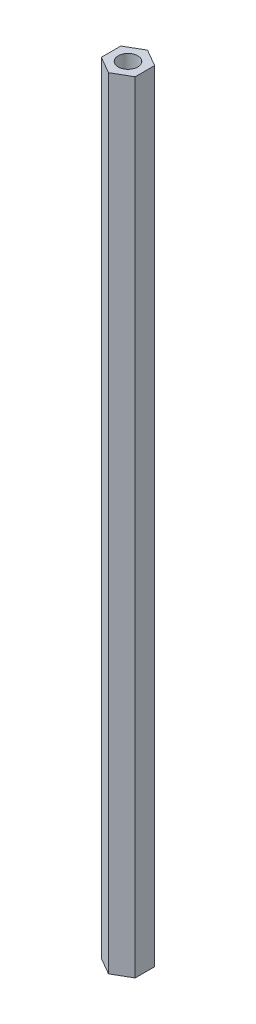
ISO-10303-21;
HEADER;
FILE_DESCRIPTION(('STEP AP214'),'2;1');
FILE_NAME('part.step','',(''),(''),'','','');
FILE_SCHEMA(('AUTOMOTIVE_DESIGN { 1 0 10303 214 1 1 1 1 }'));
ENDSEC;
DATA;
#1=APPLICATION_CONTEXT('core data for automotive mechanical design processes');
#2=APPLICATION_PROTOCOL_DEFINITION('international standard','automotive_design',2000,#1);
#3=PRODUCT_CONTEXT('',#1,'mechanical');
#4=PRODUCT('Part','Part','',(#3));
#5=PRODUCT_RELATED_PRODUCT_CATEGORY('part','',(#4));
#6=PRODUCT_DEFINITION_FORMATION('','',#4);
#7=PRODUCT_DEFINITION_CONTEXT('part definition',#1,'design');
#8=PRODUCT_DEFINITION('design','',#6,#7);
#9=PRODUCT_DEFINITION_SHAPE('','',#8);
#10=(LENGTH_UNIT() NAMED_UNIT(*) SI_UNIT(.MILLI.,.METRE.));
#11=(NAMED_UNIT(*) PLANE_ANGLE_UNIT() SI_UNIT($,.RADIAN.));
#12=(NAMED_UNIT(*) SI_UNIT($,.STERADIAN.) SOLID_ANGLE_UNIT());
#13=UNCERTAINTY_MEASURE_WITH_UNIT(LENGTH_MEASURE(1.E-05),#10,'distance_accuracy_value','');
#14=(GEOMETRIC_REPRESENTATION_CONTEXT(3) GLOBAL_UNCERTAINTY_ASSIGNED_CONTEXT((#13)) GLOBAL_UNIT_ASSIGNED_CONTEXT((#10,
#11,#12)) REPRESENTATION_CONTEXT('',''));
#15=CARTESIAN_POINT('',(0.,0.,0.));
#16=DIRECTION('',(0.,0.,1.));
#17=DIRECTION('',(1.,0.,0.));
#18=AXIS2_PLACEMENT_3D('',#15,#16,#17);
#19=CARTESIAN_POINT('',(0.,200.,-5.));
#20=DIRECTION('',(0.,1.,0.));
#21=DIRECTION('',(0.,0.,1.));
#22=AXIS2_PLACEMENT_3D('',#19,#20,#21);
#23=PLANE('',#22);
#24=DIRECTION('',(-0.866025403784439,0.,-0.5));
#25=VECTOR('',#24,1.);
#26=CARTESIAN_POINT('',(4.33012701892219,200.,-2.5));
#27=LINE('',#26,#25);
#28=CARTESIAN_POINT('',(4.33012701892219,200.,-2.5));
#29=VERTEX_POINT('',#28);
#30=CARTESIAN_POINT('',(0.,200.,-5.));
#31=VERTEX_POINT('',#30);
#32=EDGE_CURVE('E127',#29,#31,#27,.T.);
#33=ORIENTED_EDGE('',*,*,#32,.T.);
#34=DIRECTION('',(-0.866025403784439,0.,0.5));
#35=VECTOR('',#34,1.);
#36=CARTESIAN_POINT('',(0.,200.,-5.));
#37=LINE('',#36,#35);
#38=CARTESIAN_POINT('',(-4.33012701892219,200.,-2.5));
#39=VERTEX_POINT('',#38);
#40=EDGE_CURVE('E85',#31,#39,#37,.T.);
#41=ORIENTED_EDGE('',*,*,#40,.T.);
#42=DIRECTION('',(0.,0.,1.));
#43=VECTOR('',#42,1.);
#44=CARTESIAN_POINT('',(-4.33012701892219,200.,-2.5));
#45=LINE('',#44,#43);
#46=CARTESIAN_POINT('',(-4.33012701892219,200.,2.5));
#47=VERTEX_POINT('',#46);
#48=EDGE_CURVE('E98',#39,#47,#45,.T.);
#49=ORIENTED_EDGE('',*,*,#48,.T.);
#50=DIRECTION('',(0.866025403784439,0.,0.5));
#51=VECTOR('',#50,1.);
#52=CARTESIAN_POINT('',(-4.33012701892219,200.,2.5));
#53=LINE('',#52,#51);
#54=CARTESIAN_POINT('',(0.,200.,5.));
#55=VERTEX_POINT('',#54);
#56=EDGE_CURVE('E92',#47,#55,#53,.T.);
#57=ORIENTED_EDGE('',*,*,#56,.T.);
#58=DIRECTION('',(0.866025403784439,0.,-0.5));
#59=VECTOR('',#58,1.);
#60=CARTESIAN_POINT('',(0.,200.,5.));
#61=LINE('',#60,#59);
#62=CARTESIAN_POINT('',(4.33012701892219,200.,2.5));
#63=VERTEX_POINT('',#62);
#64=EDGE_CURVE('E96',#55,#63,#61,.T.);
#65=ORIENTED_EDGE('',*,*,#64,.T.);
#66=DIRECTION('',(0.,0.,-1.));
#67=VECTOR('',#66,1.);
#68=CARTESIAN_POINT('',(4.33012701892219,200.,2.5));
#69=LINE('',#68,#67);
#70=EDGE_CURVE('E48',#63,#29,#69,.T.);
#71=ORIENTED_EDGE('',*,*,#70,.T.);
#72=EDGE_LOOP('',(#33,#41,#49,#57,#65,#71));
#73=FACE_BOUND('',#72,.T.);
#74=CARTESIAN_POINT('',(0.,200.,0.));
#75=DIRECTION('',(0.,1.,0.));
#76=DIRECTION('',(0.,0.,1.));
#77=AXIS2_PLACEMENT_3D('',#74,#75,#76);
#78=CIRCLE('',#77,2.5);
#79=CARTESIAN_POINT('',(0.,200.,2.5));
#80=VERTEX_POINT('',#79);
#81=EDGE_CURVE('E120',#80,#80,#78,.T.);
#82=ORIENTED_EDGE('',*,*,#81,.F.);
#83=EDGE_LOOP('',(#82));
#84=FACE_BOUND('',#83,.T.);
#85=ADVANCED_FACE('F31',(#73,#84),#23,.T.);
#86=CARTESIAN_POINT('',(0.,0.,-5.));
#87=DIRECTION('',(0.,1.,0.));
#88=DIRECTION('',(0.,0.,1.));
#89=AXIS2_PLACEMENT_3D('',#86,#87,#88);
#90=PLANE('',#89);
#91=DIRECTION('',(-0.866025403784439,0.,-0.5));
#92=VECTOR('',#91,1.);
#93=CARTESIAN_POINT('',(4.33012701892219,0.,-2.5));
#94=LINE('',#93,#92);
#95=CARTESIAN_POINT('',(4.33012701892219,0.,-2.5));
#96=VERTEX_POINT('',#95);
#97=CARTESIAN_POINT('',(0.,0.,-5.));
#98=VERTEX_POINT('',#97);
#99=EDGE_CURVE('E116',#96,#98,#94,.T.);
#100=ORIENTED_EDGE('',*,*,#99,.F.);
#101=DIRECTION('',(0.,0.,-1.));
#102=VECTOR('',#101,1.);
#103=CARTESIAN_POINT('',(4.33012701892219,0.,2.5));
#104=LINE('',#103,#102);
#105=CARTESIAN_POINT('',(4.33012701892219,0.,2.5));
#106=VERTEX_POINT('',#105);
#107=EDGE_CURVE('E77',#106,#96,#104,.T.);
#108=ORIENTED_EDGE('',*,*,#107,.F.);
#109=DIRECTION('',(0.866025403784439,0.,-0.5));
#110=VECTOR('',#109,1.);
#111=CARTESIAN_POINT('',(0.,0.,5.));
#112=LINE('',#111,#110);
#113=CARTESIAN_POINT('',(0.,0.,5.));
#114=VERTEX_POINT('',#113);
#115=EDGE_CURVE('E71',#114,#106,#112,.T.);
#116=ORIENTED_EDGE('',*,*,#115,.F.);
#117=DIRECTION('',(0.866025403784439,0.,0.5));
#118=VECTOR('',#117,1.);
#119=CARTESIAN_POINT('',(-4.33012701892219,0.,2.5));
#120=LINE('',#119,#118);
#121=CARTESIAN_POINT('',(-4.33012701892219,0.,2.5));
#122=VERTEX_POINT('',#121);
#123=EDGE_CURVE('E106',#122,#114,#120,.T.);
#124=ORIENTED_EDGE('',*,*,#123,.F.);
#125=DIRECTION('',(0.,0.,1.));
#126=VECTOR('',#125,1.);
#127=CARTESIAN_POINT('',(-4.33012701892219,0.,-2.5));
#128=LINE('',#127,#126);
#129=CARTESIAN_POINT('',(-4.33012701892219,0.,-2.5));
#130=VERTEX_POINT('',#129);
#131=EDGE_CURVE('E122',#130,#122,#128,.T.);
#132=ORIENTED_EDGE('',*,*,#131,.F.);
#133=DIRECTION('',(-0.866025403784439,0.,0.5));
#134=VECTOR('',#133,1.);
#135=CARTESIAN_POINT('',(0.,0.,-5.));
#136=LINE('',#135,#134);
#137=EDGE_CURVE('E119',#98,#130,#136,.T.);
#138=ORIENTED_EDGE('',*,*,#137,.F.);
#139=EDGE_LOOP('',(#100,#108,#116,#124,#132,#138));
#140=FACE_BOUND('',#139,.T.);
#141=CARTESIAN_POINT('',(0.,0.,0.));
#142=DIRECTION('',(0.,1.,0.));
#143=DIRECTION('',(0.,0.,1.));
#144=AXIS2_PLACEMENT_3D('',#141,#142,#143);
#145=CIRCLE('',#144,2.5);
#146=CARTESIAN_POINT('',(0.,0.,2.5));
#147=VERTEX_POINT('',#146);
#148=EDGE_CURVE('E220',#147,#147,#145,.T.);
#149=ORIENTED_EDGE('',*,*,#148,.T.);
#150=EDGE_LOOP('',(#149));
#151=FACE_BOUND('',#150,.T.);
#152=ADVANCED_FACE('F136',(#140,#151),#90,.F.);
#153=CARTESIAN_POINT('',(4.33012701892219,200.,-2.5));
#154=DIRECTION('',(-0.5,0.,0.866025403784439));
#155=DIRECTION('',(0.866025403784439,0.,0.5));
#156=AXIS2_PLACEMENT_3D('',#153,#154,#155);
#157=PLANE('',#156);
#158=ORIENTED_EDGE('',*,*,#99,.T.);
#159=DIRECTION('',(0.,-1.,0.));
#160=VECTOR('',#159,1.);
#161=CARTESIAN_POINT('',(0.,200.,-5.));
#162=LINE('',#161,#160);
#163=EDGE_CURVE('E11',#31,#98,#162,.T.);
#164=ORIENTED_EDGE('',*,*,#163,.F.);
#165=ORIENTED_EDGE('',*,*,#32,.F.);
#166=DIRECTION('',(0.,-1.,0.));
#167=VECTOR('',#166,1.);
#168=CARTESIAN_POINT('',(4.33012701892219,200.,-2.5));
#169=LINE('',#168,#167);
#170=EDGE_CURVE('E112',#29,#96,#169,.T.);
#171=ORIENTED_EDGE('',*,*,#170,.T.);
#172=EDGE_LOOP('',(#158,#164,#165,#171));
#173=FACE_BOUND('',#172,.T.);
#174=ADVANCED_FACE('F33',(#173),#157,.F.);
#175=CARTESIAN_POINT('',(0.,200.,-5.));
#176=DIRECTION('',(0.5,0.,0.866025403784439));
#177=DIRECTION('',(0.866025403784439,0.,-0.5));
#178=AXIS2_PLACEMENT_3D('',#175,#176,#177);
#179=PLANE('',#178);
#180=ORIENTED_EDGE('',*,*,#137,.T.);
#181=DIRECTION('',(0.,-1.,0.));
#182=VECTOR('',#181,1.);
#183=CARTESIAN_POINT('',(-4.33012701892219,200.,-2.5));
#184=LINE('',#183,#182);
#185=EDGE_CURVE('E40',#39,#130,#184,.T.);
#186=ORIENTED_EDGE('',*,*,#185,.F.);
#187=ORIENTED_EDGE('',*,*,#40,.F.);
#188=ORIENTED_EDGE('',*,*,#163,.T.);
#189=EDGE_LOOP('',(#180,#186,#187,#188));
#190=FACE_BOUND('',#189,.T.);
#191=ADVANCED_FACE('F161',(#190),#179,.F.);
#192=CARTESIAN_POINT('',(-4.33012701892219,200.,-2.5));
#193=DIRECTION('',(1.,0.,0.));
#194=DIRECTION('',(0.,0.,-1.));
#195=AXIS2_PLACEMENT_3D('',#192,#193,#194);
#196=PLANE('',#195);
#197=ORIENTED_EDGE('',*,*,#131,.T.);
#198=DIRECTION('',(0.,-1.,0.));
#199=VECTOR('',#198,1.);
#200=CARTESIAN_POINT('',(-4.33012701892219,200.,2.5));
#201=LINE('',#200,#199);
#202=EDGE_CURVE('E107',#47,#122,#201,.T.);
#203=ORIENTED_EDGE('',*,*,#202,.F.);
#204=ORIENTED_EDGE('',*,*,#48,.F.);
#205=ORIENTED_EDGE('',*,*,#185,.T.);
#206=EDGE_LOOP('',(#197,#203,#204,#205));
#207=FACE_BOUND('',#206,.T.);
#208=ADVANCED_FACE('F133',(#207),#196,.F.);
#209=CARTESIAN_POINT('',(-4.33012701892219,200.,2.5));
#210=DIRECTION('',(0.5,0.,-0.866025403784439));
#211=DIRECTION('',(-0.866025403784439,0.,-0.5));
#212=AXIS2_PLACEMENT_3D('',#209,#210,#211);
#213=PLANE('',#212);
#214=ORIENTED_EDGE('',*,*,#123,.T.);
#215=DIRECTION('',(0.,-1.,0.));
#216=VECTOR('',#215,1.);
#217=CARTESIAN_POINT('',(0.,200.,5.));
#218=LINE('',#217,#216);
#219=EDGE_CURVE('E103',#55,#114,#218,.T.);
#220=ORIENTED_EDGE('',*,*,#219,.F.);
#221=ORIENTED_EDGE('',*,*,#56,.F.);
#222=ORIENTED_EDGE('',*,*,#202,.T.);
#223=EDGE_LOOP('',(#214,#220,#221,#222));
#224=FACE_BOUND('',#223,.T.);
#225=ADVANCED_FACE('F104',(#224),#213,.F.);
#226=CARTESIAN_POINT('',(0.,200.,5.));
#227=DIRECTION('',(-0.5,0.,-0.866025403784439));
#228=DIRECTION('',(-0.866025403784439,0.,0.5));
#229=AXIS2_PLACEMENT_3D('',#226,#227,#228);
#230=PLANE('',#229);
#231=ORIENTED_EDGE('',*,*,#115,.T.);
#232=DIRECTION('',(0.,-1.,0.));
#233=VECTOR('',#232,1.);
#234=CARTESIAN_POINT('',(4.33012701892219,200.,2.5));
#235=LINE('',#234,#233);
#236=EDGE_CURVE('E108',#63,#106,#235,.T.);
#237=ORIENTED_EDGE('',*,*,#236,.F.);
#238=ORIENTED_EDGE('',*,*,#64,.F.);
#239=ORIENTED_EDGE('',*,*,#219,.T.);
#240=EDGE_LOOP('',(#231,#237,#238,#239));
#241=FACE_BOUND('',#240,.T.);
#242=ADVANCED_FACE('F110',(#241),#230,.F.);
#243=CARTESIAN_POINT('',(4.33012701892219,200.,2.5));
#244=DIRECTION('',(-1.,0.,0.));
#245=DIRECTION('',(0.,0.,1.));
#246=AXIS2_PLACEMENT_3D('',#243,#244,#245);
#247=PLANE('',#246);
#248=ORIENTED_EDGE('',*,*,#107,.T.);
#249=ORIENTED_EDGE('',*,*,#170,.F.);
#250=ORIENTED_EDGE('',*,*,#70,.F.);
#251=ORIENTED_EDGE('',*,*,#236,.T.);
#252=EDGE_LOOP('',(#248,#249,#250,#251));
#253=FACE_BOUND('',#252,.T.);
#254=ADVANCED_FACE('F141',(#253),#247,.F.);
#255=CARTESIAN_POINT('',(0.,200.,0.));
#256=DIRECTION('',(0.,-1.,0.));
#257=DIRECTION('',(0.,0.,-1.));
#258=AXIS2_PLACEMENT_3D('',#255,#256,#257);
#259=CYLINDRICAL_SURFACE('',#258,2.5);
#260=ORIENTED_EDGE('',*,*,#81,.T.);
#261=EDGE_LOOP('',(#260));
#262=FACE_BOUND('',#261,.T.);
#263=ORIENTED_EDGE('',*,*,#148,.F.);
#264=EDGE_LOOP('',(#263));
#265=FACE_BOUND('',#264,.T.);
#266=ADVANCED_FACE('F143',(#262,#265),#259,.F.);
#267=CLOSED_SHELL('',(#85,#152,#174,#191,#208,#225,#242,#254,#266));
#268=MANIFOLD_SOLID_BREP('B2',#267);
#269=ADVANCED_BREP_SHAPE_REPRESENTATION('',(#18,#268),#14);
#270=SHAPE_DEFINITION_REPRESENTATION(#9,#269);
ENDSEC;
END-ISO-10303-21;
